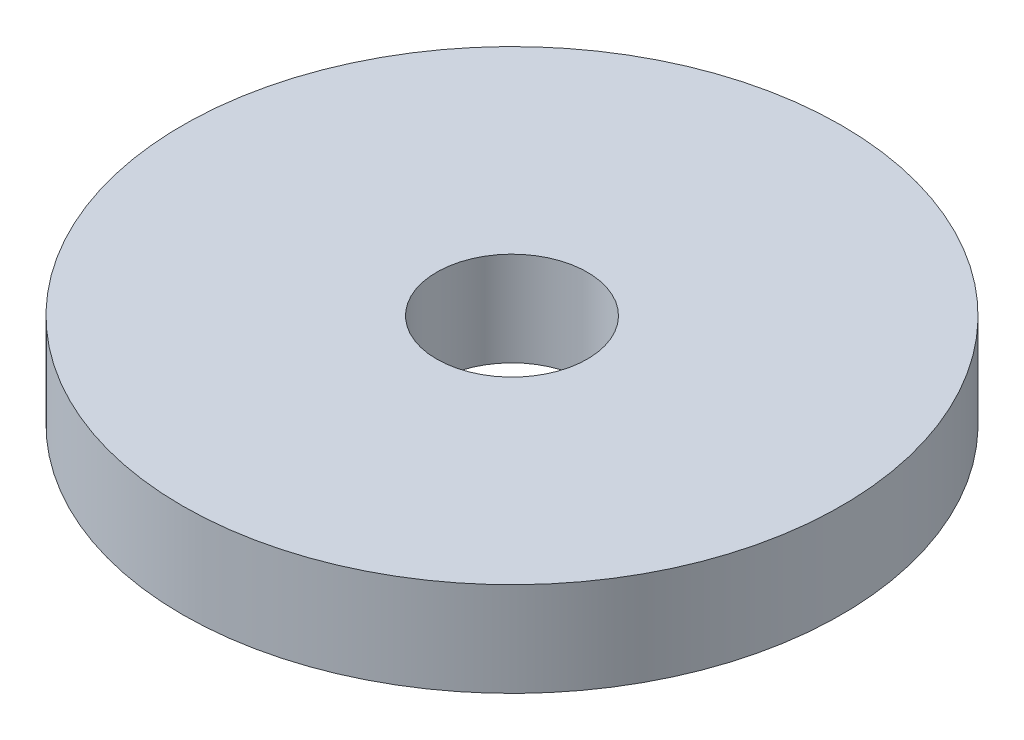
ISO-10303-21;
HEADER;
FILE_DESCRIPTION(('STEP AP214'),'2;1');
FILE_NAME('part.step','',(''),(''),'','','');
FILE_SCHEMA(('AUTOMOTIVE_DESIGN { 1 0 10303 214 1 1 1 1 }'));
ENDSEC;
DATA;
#1=APPLICATION_CONTEXT('core data for automotive mechanical design processes');
#2=APPLICATION_PROTOCOL_DEFINITION('international standard','automotive_design',2000,#1);
#3=PRODUCT_CONTEXT('',#1,'mechanical');
#4=PRODUCT('Part','Part','',(#3));
#5=PRODUCT_RELATED_PRODUCT_CATEGORY('part','',(#4));
#6=PRODUCT_DEFINITION_FORMATION('','',#4);
#7=PRODUCT_DEFINITION_CONTEXT('part definition',#1,'design');
#8=PRODUCT_DEFINITION('design','',#6,#7);
#9=PRODUCT_DEFINITION_SHAPE('','',#8);
#10=(LENGTH_UNIT() NAMED_UNIT(*) SI_UNIT(.MILLI.,.METRE.));
#11=(NAMED_UNIT(*) PLANE_ANGLE_UNIT() SI_UNIT($,.RADIAN.));
#12=(NAMED_UNIT(*) SI_UNIT($,.STERADIAN.) SOLID_ANGLE_UNIT());
#13=UNCERTAINTY_MEASURE_WITH_UNIT(LENGTH_MEASURE(1.E-05),#10,'distance_accuracy_value','');
#14=(GEOMETRIC_REPRESENTATION_CONTEXT(3) GLOBAL_UNCERTAINTY_ASSIGNED_CONTEXT((#13)) GLOBAL_UNIT_ASSIGNED_CONTEXT((#10,
#11,#12)) REPRESENTATION_CONTEXT('',''));
#15=CARTESIAN_POINT('',(0.,0.,0.));
#16=DIRECTION('',(0.,0.,1.));
#17=DIRECTION('',(1.,0.,0.));
#18=AXIS2_PLACEMENT_3D('',#15,#16,#17);
#19=CARTESIAN_POINT('',(0.,2.,0.));
#20=DIRECTION('',(0.,1.,0.));
#21=DIRECTION('',(0.,0.,1.));
#22=AXIS2_PLACEMENT_3D('',#19,#20,#21);
#23=PLANE('',#22);
#24=CARTESIAN_POINT('',(0.,2.,0.));
#25=DIRECTION('',(0.,1.,0.));
#26=DIRECTION('',(0.,0.,1.));
#27=AXIS2_PLACEMENT_3D('',#24,#25,#26);
#28=CIRCLE('',#27,7.);
#29=CARTESIAN_POINT('',(0.,2.,7.));
#30=VERTEX_POINT('',#29);
#31=EDGE_CURVE('E10',#30,#30,#28,.T.);
#32=ORIENTED_EDGE('',*,*,#31,.T.);
#33=EDGE_LOOP('',(#32));
#34=FACE_BOUND('',#33,.T.);
#35=CARTESIAN_POINT('',(0.,2.,0.));
#36=DIRECTION('',(0.,1.,0.));
#37=DIRECTION('',(0.,0.,1.));
#38=AXIS2_PLACEMENT_3D('',#35,#36,#37);
#39=CIRCLE('',#38,1.6);
#40=CARTESIAN_POINT('',(0.,2.,1.6));
#41=VERTEX_POINT('',#40);
#42=EDGE_CURVE('E42',#41,#41,#39,.T.);
#43=ORIENTED_EDGE('',*,*,#42,.F.);
#44=EDGE_LOOP('',(#43));
#45=FACE_BOUND('',#44,.T.);
#46=ADVANCED_FACE('F31',(#34,#45),#23,.T.);
#47=CARTESIAN_POINT('',(0.,0.,0.));
#48=DIRECTION('',(0.,1.,0.));
#49=DIRECTION('',(0.,0.,1.));
#50=AXIS2_PLACEMENT_3D('',#47,#48,#49);
#51=PLANE('',#50);
#52=CARTESIAN_POINT('',(0.,0.,0.));
#53=DIRECTION('',(0.,1.,0.));
#54=DIRECTION('',(0.,0.,1.));
#55=AXIS2_PLACEMENT_3D('',#52,#53,#54);
#56=CIRCLE('',#55,7.);
#57=CARTESIAN_POINT('',(0.,0.,7.));
#58=VERTEX_POINT('',#57);
#59=EDGE_CURVE('E35',#58,#58,#56,.T.);
#60=ORIENTED_EDGE('',*,*,#59,.F.);
#61=EDGE_LOOP('',(#60));
#62=FACE_BOUND('',#61,.T.);
#63=CARTESIAN_POINT('',(0.,0.,0.));
#64=DIRECTION('',(0.,1.,0.));
#65=DIRECTION('',(0.,0.,1.));
#66=AXIS2_PLACEMENT_3D('',#63,#64,#65);
#67=CIRCLE('',#66,1.6);
#68=CARTESIAN_POINT('',(0.,0.,1.6));
#69=VERTEX_POINT('',#68);
#70=EDGE_CURVE('E44',#69,#69,#67,.T.);
#71=ORIENTED_EDGE('',*,*,#70,.T.);
#72=EDGE_LOOP('',(#71));
#73=FACE_BOUND('',#72,.T.);
#74=ADVANCED_FACE('F54',(#62,#73),#51,.F.);
#75=CARTESIAN_POINT('',(0.,2.,0.));
#76=DIRECTION('',(0.,-1.,0.));
#77=DIRECTION('',(0.,0.,-1.));
#78=AXIS2_PLACEMENT_3D('',#75,#76,#77);
#79=CYLINDRICAL_SURFACE('',#78,7.);
#80=ORIENTED_EDGE('',*,*,#31,.F.);
#81=EDGE_LOOP('',(#80));
#82=FACE_BOUND('',#81,.T.);
#83=ORIENTED_EDGE('',*,*,#59,.T.);
#84=EDGE_LOOP('',(#83));
#85=FACE_BOUND('',#84,.T.);
#86=ADVANCED_FACE('F33',(#82,#85),#79,.T.);
#87=CARTESIAN_POINT('',(0.,2.,0.));
#88=DIRECTION('',(0.,-1.,0.));
#89=DIRECTION('',(0.,0.,-1.));
#90=AXIS2_PLACEMENT_3D('',#87,#88,#89);
#91=CYLINDRICAL_SURFACE('',#90,1.6);
#92=ORIENTED_EDGE('',*,*,#42,.T.);
#93=EDGE_LOOP('',(#92));
#94=FACE_BOUND('',#93,.T.);
#95=ORIENTED_EDGE('',*,*,#70,.F.);
#96=EDGE_LOOP('',(#95));
#97=FACE_BOUND('',#96,.T.);
#98=ADVANCED_FACE('F50',(#94,#97),#91,.F.);
#99=CLOSED_SHELL('',(#46,#74,#86,#98));
#100=MANIFOLD_SOLID_BREP('B2',#99);
#101=ADVANCED_BREP_SHAPE_REPRESENTATION('',(#18,#100),#14);
#102=SHAPE_DEFINITION_REPRESENTATION(#9,#101);
ENDSEC;
END-ISO-10303-21;
